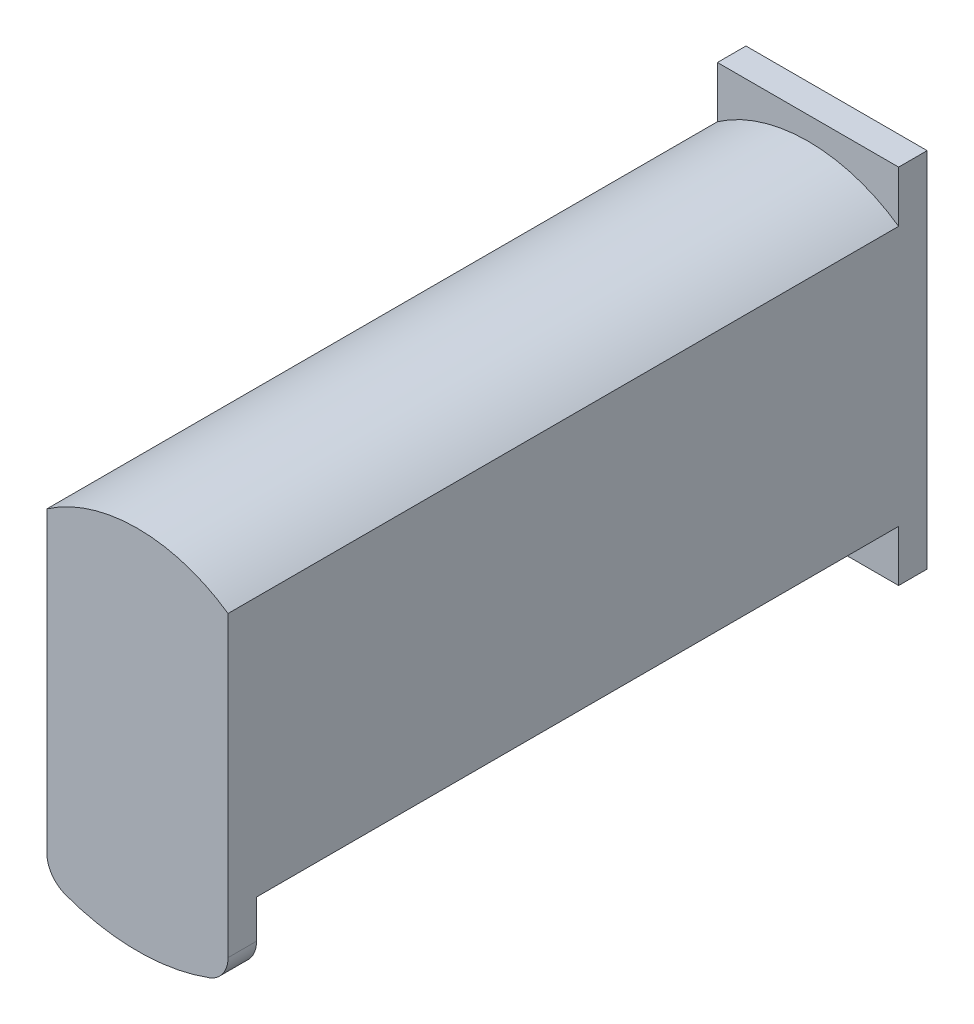
ISO-10303-21;
HEADER;
FILE_DESCRIPTION(('STEP AP214'),'2;1');
FILE_NAME('part.step','',(''),(''),'','','');
FILE_SCHEMA(('AUTOMOTIVE_DESIGN { 1 0 10303 214 1 1 1 1 }'));
ENDSEC;
DATA;
#1=APPLICATION_CONTEXT('core data for automotive mechanical design processes');
#2=APPLICATION_PROTOCOL_DEFINITION('international standard','automotive_design',2000,#1);
#3=PRODUCT_CONTEXT('',#1,'mechanical');
#4=PRODUCT('Part','Part','',(#3));
#5=PRODUCT_RELATED_PRODUCT_CATEGORY('part','',(#4));
#6=PRODUCT_DEFINITION_FORMATION('','',#4);
#7=PRODUCT_DEFINITION_CONTEXT('part definition',#1,'design');
#8=PRODUCT_DEFINITION('design','',#6,#7);
#9=PRODUCT_DEFINITION_SHAPE('','',#8);
#10=(LENGTH_UNIT() NAMED_UNIT(*) SI_UNIT(.MILLI.,.METRE.));
#11=(NAMED_UNIT(*) PLANE_ANGLE_UNIT() SI_UNIT($,.RADIAN.));
#12=(NAMED_UNIT(*) SI_UNIT($,.STERADIAN.) SOLID_ANGLE_UNIT());
#13=UNCERTAINTY_MEASURE_WITH_UNIT(LENGTH_MEASURE(1.E-05),#10,'distance_accuracy_value','');
#14=(GEOMETRIC_REPRESENTATION_CONTEXT(3) GLOBAL_UNCERTAINTY_ASSIGNED_CONTEXT((#13)) GLOBAL_UNIT_ASSIGNED_CONTEXT((#10,
#11,#12)) REPRESENTATION_CONTEXT('',''));
#15=CARTESIAN_POINT('',(0.,0.,0.));
#16=DIRECTION('',(0.,0.,1.));
#17=DIRECTION('',(1.,0.,0.));
#18=AXIS2_PLACEMENT_3D('',#15,#16,#17);
#19=CARTESIAN_POINT('',(5.74999999999999,19.2,14.));
#20=DIRECTION('',(1.,0.,0.));
#21=DIRECTION('',(0.,1.,0.));
#22=AXIS2_PLACEMENT_3D('',#19,#20,#21);
#23=PLANE('',#22);
#24=DIRECTION('',(0.,-1.,0.));
#25=VECTOR('',#24,1.);
#26=CARTESIAN_POINT('',(5.74999999999999,19.2,8.));
#27=LINE('',#26,#25);
#28=CARTESIAN_POINT('',(5.74999999999999,19.2,8.));
#29=VERTEX_POINT('',#28);
#30=CARTESIAN_POINT('',(5.74999999999999,6.2,8.));
#31=VERTEX_POINT('',#30);
#32=EDGE_CURVE('E271',#29,#31,#27,.T.);
#33=ORIENTED_EDGE('',*,*,#32,.T.);
#34=DIRECTION('',(0.,0.,-1.));
#35=VECTOR('',#34,1.);
#36=CARTESIAN_POINT('',(5.74999999999999,6.2,14.));
#37=LINE('',#36,#35);
#38=CARTESIAN_POINT('',(5.74999999999999,6.2,14.));
#39=VERTEX_POINT('',#38);
#40=EDGE_CURVE('E287',#39,#31,#37,.T.);
#41=ORIENTED_EDGE('',*,*,#40,.F.);
#42=DIRECTION('',(0.,-1.,0.));
#43=VECTOR('',#42,1.);
#44=CARTESIAN_POINT('',(5.74999999999999,19.2,14.));
#45=LINE('',#44,#43);
#46=CARTESIAN_POINT('',(5.74999999999999,19.2,14.));
#47=VERTEX_POINT('',#46);
#48=EDGE_CURVE('E299',#47,#39,#45,.T.);
#49=ORIENTED_EDGE('',*,*,#48,.F.);
#50=DIRECTION('',(0.,0.,-1.));
#51=VECTOR('',#50,1.);
#52=CARTESIAN_POINT('',(5.74999999999999,19.2,14.));
#53=LINE('',#52,#51);
#54=EDGE_CURVE('E254',#47,#29,#53,.T.);
#55=ORIENTED_EDGE('',*,*,#54,.T.);
#56=EDGE_LOOP('',(#33,#41,#49,#55));
#57=FACE_BOUND('',#56,.T.);
#58=ADVANCED_FACE('F69',(#57),#23,.F.);
#59=CARTESIAN_POINT('',(5.74999999999999,19.2,14.));
#60=DIRECTION('',(0.,-1.,0.));
#61=DIRECTION('',(1.,0.,0.));
#62=AXIS2_PLACEMENT_3D('',#59,#60,#61);
#63=PLANE('',#62);
#64=DIRECTION('',(-1.,0.,0.));
#65=VECTOR('',#64,1.);
#66=CARTESIAN_POINT('',(5.74999999999999,19.2,8.));
#67=LINE('',#66,#65);
#68=CARTESIAN_POINT('',(-5.75000000000001,19.2,8.));
#69=VERTEX_POINT('',#68);
#70=EDGE_CURVE('E296',#29,#69,#67,.T.);
#71=ORIENTED_EDGE('',*,*,#70,.F.);
#72=ORIENTED_EDGE('',*,*,#54,.F.);
#73=DIRECTION('',(-1.,0.,0.));
#74=VECTOR('',#73,1.);
#75=CARTESIAN_POINT('',(5.74999999999999,19.2,14.));
#76=LINE('',#75,#74);
#77=CARTESIAN_POINT('',(-5.75000000000001,19.2,14.));
#78=VERTEX_POINT('',#77);
#79=EDGE_CURVE('E289',#47,#78,#76,.T.);
#80=ORIENTED_EDGE('',*,*,#79,.T.);
#81=DIRECTION('',(0.,0.,-1.));
#82=VECTOR('',#81,1.);
#83=CARTESIAN_POINT('',(-5.75000000000001,19.2,14.));
#84=LINE('',#83,#82);
#85=EDGE_CURVE('E292',#78,#69,#84,.T.);
#86=ORIENTED_EDGE('',*,*,#85,.T.);
#87=EDGE_LOOP('',(#71,#72,#80,#86));
#88=FACE_BOUND('',#87,.T.);
#89=ADVANCED_FACE('F407',(#88),#63,.T.);
#90=CARTESIAN_POINT('',(-5.75000000000001,19.2,14.));
#91=DIRECTION('',(1.,0.,0.));
#92=DIRECTION('',(0.,1.,0.));
#93=AXIS2_PLACEMENT_3D('',#90,#91,#92);
#94=PLANE('',#93);
#95=DIRECTION('',(0.,-1.,0.));
#96=VECTOR('',#95,1.);
#97=CARTESIAN_POINT('',(-5.75000000000001,19.2,8.));
#98=LINE('',#97,#96);
#99=CARTESIAN_POINT('',(-5.75000000000001,6.2,8.));
#100=VERTEX_POINT('',#99);
#101=EDGE_CURVE('E298',#69,#100,#98,.T.);
#102=ORIENTED_EDGE('',*,*,#101,.F.);
#103=ORIENTED_EDGE('',*,*,#85,.F.);
#104=DIRECTION('',(0.,-1.,0.));
#105=VECTOR('',#104,1.);
#106=CARTESIAN_POINT('',(-5.75000000000001,19.2,14.));
#107=LINE('',#106,#105);
#108=CARTESIAN_POINT('',(-5.75000000000001,6.2,14.));
#109=VERTEX_POINT('',#108);
#110=EDGE_CURVE('E308',#78,#109,#107,.T.);
#111=ORIENTED_EDGE('',*,*,#110,.T.);
#112=DIRECTION('',(0.,0.,-1.));
#113=VECTOR('',#112,1.);
#114=CARTESIAN_POINT('',(-5.75000000000001,6.2,14.));
#115=LINE('',#114,#113);
#116=EDGE_CURVE('E290',#109,#100,#115,.T.);
#117=ORIENTED_EDGE('',*,*,#116,.T.);
#118=EDGE_LOOP('',(#102,#103,#111,#117));
#119=FACE_BOUND('',#118,.T.);
#120=ADVANCED_FACE('F413',(#119),#94,.T.);
#121=CARTESIAN_POINT('',(5.74999999999999,6.2,14.));
#122=DIRECTION('',(0.,-1.,0.));
#123=DIRECTION('',(1.,0.,0.));
#124=AXIS2_PLACEMENT_3D('',#121,#122,#123);
#125=PLANE('',#124);
#126=DIRECTION('',(-1.,0.,0.));
#127=VECTOR('',#126,1.);
#128=CARTESIAN_POINT('',(5.74999999999999,6.2,8.));
#129=LINE('',#128,#127);
#130=EDGE_CURVE('E302',#31,#100,#129,.T.);
#131=ORIENTED_EDGE('',*,*,#130,.T.);
#132=ORIENTED_EDGE('',*,*,#116,.F.);
#133=DIRECTION('',(-1.,0.,0.));
#134=VECTOR('',#133,1.);
#135=CARTESIAN_POINT('',(5.74999999999999,6.2,14.));
#136=LINE('',#135,#134);
#137=EDGE_CURVE('E310',#39,#109,#136,.T.);
#138=ORIENTED_EDGE('',*,*,#137,.F.);
#139=ORIENTED_EDGE('',*,*,#40,.T.);
#140=EDGE_LOOP('',(#131,#132,#138,#139));
#141=FACE_BOUND('',#140,.T.);
#142=ADVANCED_FACE('F420',(#141),#125,.F.);
#143=CARTESIAN_POINT('',(0.,0.,14.));
#144=DIRECTION('',(0.,0.,-1.));
#145=DIRECTION('',(-1.,0.,0.));
#146=AXIS2_PLACEMENT_3D('',#143,#144,#145);
#147=PLANE('',#146);
#148=CARTESIAN_POINT('',(0.,12.7,14.));
#149=DIRECTION('',(0.,0.,-1.));
#150=DIRECTION('',(-1.,0.,0.));
#151=AXIS2_PLACEMENT_3D('',#148,#149,#150);
#152=CIRCLE('',#151,3.5);
#153=CARTESIAN_POINT('',(-3.5,12.7,14.));
#154=VERTEX_POINT('',#153);
#155=EDGE_CURVE('E247',#154,#154,#152,.F.);
#156=ORIENTED_EDGE('',*,*,#155,.T.);
#157=EDGE_LOOP('',(#156));
#158=FACE_BOUND('',#157,.T.);
#159=ORIENTED_EDGE('',*,*,#48,.T.);
#160=ORIENTED_EDGE('',*,*,#137,.T.);
#161=ORIENTED_EDGE('',*,*,#110,.F.);
#162=ORIENTED_EDGE('',*,*,#79,.F.);
#163=EDGE_LOOP('',(#159,#160,#161,#162));
#164=FACE_BOUND('',#163,.T.);
#165=ADVANCED_FACE('F423',(#158,#164),#147,.T.);
#166=CARTESIAN_POINT('',(0.,0.,8.));
#167=DIRECTION('',(0.,0.,-1.));
#168=DIRECTION('',(-1.,0.,0.));
#169=AXIS2_PLACEMENT_3D('',#166,#167,#168);
#170=PLANE('',#169);
#171=CARTESIAN_POINT('',(0.,12.7,8.));
#172=DIRECTION('',(0.,0.,-1.));
#173=DIRECTION('',(-1.,0.,0.));
#174=AXIS2_PLACEMENT_3D('',#171,#172,#173);
#175=CIRCLE('',#174,3.5);
#176=CARTESIAN_POINT('',(-3.5,12.7,8.));
#177=VERTEX_POINT('',#176);
#178=EDGE_CURVE('E245',#177,#177,#175,.F.);
#179=ORIENTED_EDGE('',*,*,#178,.F.);
#180=EDGE_LOOP('',(#179));
#181=FACE_BOUND('',#180,.T.);
#182=ORIENTED_EDGE('',*,*,#32,.F.);
#183=ORIENTED_EDGE('',*,*,#70,.T.);
#184=ORIENTED_EDGE('',*,*,#101,.T.);
#185=ORIENTED_EDGE('',*,*,#130,.F.);
#186=EDGE_LOOP('',(#182,#183,#184,#185));
#187=FACE_BOUND('',#186,.T.);
#188=ADVANCED_FACE('F428',(#181,#187),#170,.F.);
#189=CARTESIAN_POINT('',(0.,12.7,25.));
#190=DIRECTION('',(0.,0.,-1.));
#191=DIRECTION('',(-1.,0.,0.));
#192=AXIS2_PLACEMENT_3D('',#189,#190,#191);
#193=CYLINDRICAL_SURFACE('',#192,3.5);
#194=ORIENTED_EDGE('',*,*,#155,.F.);
#195=EDGE_LOOP('',(#194));
#196=FACE_BOUND('',#195,.T.);
#197=CARTESIAN_POINT('',(0.,12.7,25.));
#198=DIRECTION('',(0.,0.,1.));
#199=DIRECTION('',(1.,0.,0.));
#200=AXIS2_PLACEMENT_3D('',#197,#198,#199);
#201=CIRCLE('',#200,3.5);
#202=CARTESIAN_POINT('',(3.5,12.7,25.));
#203=VERTEX_POINT('',#202);
#204=EDGE_CURVE('E232',#203,#203,#201,.T.);
#205=ORIENTED_EDGE('',*,*,#204,.T.);
#206=EDGE_LOOP('',(#205));
#207=FACE_BOUND('',#206,.T.);
#208=ADVANCED_FACE('F431',(#196,#207),#193,.F.);
#209=CARTESIAN_POINT('',(0.,12.7,25.));
#210=DIRECTION('',(0.,0.,1.));
#211=DIRECTION('',(1.,0.,0.));
#212=AXIS2_PLACEMENT_3D('',#209,#210,#211);
#213=PLANE('',#212);
#214=ORIENTED_EDGE('',*,*,#204,.F.);
#215=EDGE_LOOP('',(#214));
#216=FACE_BOUND('',#215,.T.);
#217=ADVANCED_FACE('F580',(#216),#213,.F.);
#218=CARTESIAN_POINT('',(0.,0.,4.));
#219=DIRECTION('',(0.,0.,1.));
#220=DIRECTION('',(1.,0.,0.));
#221=AXIS2_PLACEMENT_3D('',#218,#219,#220);
#222=PLANE('',#221);
#223=CARTESIAN_POINT('',(0.,0.,4.));
#224=DIRECTION('',(0.,0.,1.));
#225=DIRECTION('',(1.,0.,0.));
#226=AXIS2_PLACEMENT_3D('',#223,#224,#225);
#227=CIRCLE('',#226,22.2);
#228=CARTESIAN_POINT('',(-12.7,-18.2085144918524,4.));
#229=VERTEX_POINT('',#228);
#230=CARTESIAN_POINT('',(12.7,-18.2085144918524,4.));
#231=VERTEX_POINT('',#230);
#232=EDGE_CURVE('E280',#229,#231,#227,.T.);
#233=ORIENTED_EDGE('',*,*,#232,.F.);
#234=DIRECTION('',(0.,1.,0.));
#235=VECTOR('',#234,1.);
#236=CARTESIAN_POINT('',(-12.7,-25.4,4.));
#237=LINE('',#236,#235);
#238=CARTESIAN_POINT('',(-12.7,-25.4,4.));
#239=VERTEX_POINT('',#238);
#240=EDGE_CURVE('E341',#239,#229,#237,.T.);
#241=ORIENTED_EDGE('',*,*,#240,.F.);
#242=DIRECTION('',(-1.,0.,0.));
#243=VECTOR('',#242,1.);
#244=CARTESIAN_POINT('',(12.7,-25.4,4.));
#245=LINE('',#244,#243);
#246=CARTESIAN_POINT('',(12.7,-25.4,4.));
#247=VERTEX_POINT('',#246);
#248=EDGE_CURVE('E344',#247,#239,#245,.T.);
#249=ORIENTED_EDGE('',*,*,#248,.F.);
#250=DIRECTION('',(0.,1.,0.));
#251=VECTOR('',#250,1.);
#252=CARTESIAN_POINT('',(12.7,-25.4,4.));
#253=LINE('',#252,#251);
#254=EDGE_CURVE('E335',#247,#231,#253,.T.);
#255=ORIENTED_EDGE('',*,*,#254,.T.);
#256=EDGE_LOOP('',(#233,#241,#249,#255));
#257=FACE_BOUND('',#256,.T.);
#258=ADVANCED_FACE('F453',(#257),#222,.T.);
#259=CARTESIAN_POINT('',(0.,0.,4.));
#260=DIRECTION('',(0.,0.,1.));
#261=DIRECTION('',(1.,0.,0.));
#262=AXIS2_PLACEMENT_3D('',#259,#260,#261);
#263=CIRCLE('',#262,22.2);
#264=CARTESIAN_POINT('',(12.7,18.2085144918524,4.));
#265=VERTEX_POINT('',#264);
#266=CARTESIAN_POINT('',(-12.7,18.2085144918524,4.));
#267=VERTEX_POINT('',#266);
#268=EDGE_CURVE('E319',#265,#267,#263,.T.);
#269=ORIENTED_EDGE('',*,*,#268,.F.);
#270=CARTESIAN_POINT('',(12.7,25.4,4.));
#271=VERTEX_POINT('',#270);
#272=EDGE_CURVE('E221',#265,#271,#253,.T.);
#273=ORIENTED_EDGE('',*,*,#272,.T.);
#274=DIRECTION('',(-1.,0.,0.));
#275=VECTOR('',#274,1.);
#276=CARTESIAN_POINT('',(12.7,25.4,4.));
#277=LINE('',#276,#275);
#278=CARTESIAN_POINT('',(-12.7,25.4,4.));
#279=VERTEX_POINT('',#278);
#280=EDGE_CURVE('E337',#271,#279,#277,.T.);
#281=ORIENTED_EDGE('',*,*,#280,.T.);
#282=EDGE_CURVE('E340',#267,#279,#237,.T.);
#283=ORIENTED_EDGE('',*,*,#282,.F.);
#284=EDGE_LOOP('',(#269,#273,#281,#283));
#285=FACE_BOUND('',#284,.T.);
#286=ADVANCED_FACE('F449',(#285),#222,.T.);
#287=CARTESIAN_POINT('',(0.,0.,0.));
#288=DIRECTION('',(0.,0.,1.));
#289=DIRECTION('',(1.,0.,0.));
#290=AXIS2_PLACEMENT_3D('',#287,#288,#289);
#291=PLANE('',#290);
#292=DIRECTION('',(0.,1.,0.));
#293=VECTOR('',#292,1.);
#294=CARTESIAN_POINT('',(12.7,-25.4,0.));
#295=LINE('',#294,#293);
#296=CARTESIAN_POINT('',(12.7,-25.4,0.));
#297=VERTEX_POINT('',#296);
#298=CARTESIAN_POINT('',(12.7,25.4,0.));
#299=VERTEX_POINT('',#298);
#300=EDGE_CURVE('E334',#297,#299,#295,.T.);
#301=ORIENTED_EDGE('',*,*,#300,.F.);
#302=DIRECTION('',(-1.,0.,0.));
#303=VECTOR('',#302,1.);
#304=CARTESIAN_POINT('',(12.7,-25.4,0.));
#305=LINE('',#304,#303);
#306=CARTESIAN_POINT('',(-12.7,-25.4,0.));
#307=VERTEX_POINT('',#306);
#308=EDGE_CURVE('E356',#297,#307,#305,.T.);
#309=ORIENTED_EDGE('',*,*,#308,.T.);
#310=DIRECTION('',(0.,1.,0.));
#311=VECTOR('',#310,1.);
#312=CARTESIAN_POINT('',(-12.7,-25.4,0.));
#313=LINE('',#312,#311);
#314=CARTESIAN_POINT('',(-12.7,25.4,0.));
#315=VERTEX_POINT('',#314);
#316=EDGE_CURVE('E353',#307,#315,#313,.T.);
#317=ORIENTED_EDGE('',*,*,#316,.T.);
#318=DIRECTION('',(-1.,0.,0.));
#319=VECTOR('',#318,1.);
#320=CARTESIAN_POINT('',(12.7,25.4,0.));
#321=LINE('',#320,#319);
#322=EDGE_CURVE('E350',#299,#315,#321,.T.);
#323=ORIENTED_EDGE('',*,*,#322,.F.);
#324=EDGE_LOOP('',(#301,#309,#317,#323));
#325=FACE_BOUND('',#324,.T.);
#326=CARTESIAN_POINT('',(0.,12.7,0.));
#327=DIRECTION('',(0.,0.,1.));
#328=DIRECTION('',(1.,0.,0.));
#329=AXIS2_PLACEMENT_3D('',#326,#327,#328);
#330=CIRCLE('',#329,3.5);
#331=CARTESIAN_POINT('',(3.5,12.7,0.));
#332=VERTEX_POINT('',#331);
#333=EDGE_CURVE('E331',#332,#332,#330,.T.);
#334=ORIENTED_EDGE('',*,*,#333,.T.);
#335=EDGE_LOOP('',(#334));
#336=FACE_BOUND('',#335,.T.);
#337=CARTESIAN_POINT('',(0.,-12.7,0.));
#338=DIRECTION('',(0.,0.,1.));
#339=DIRECTION('',(1.,0.,0.));
#340=AXIS2_PLACEMENT_3D('',#337,#338,#339);
#341=CIRCLE('',#340,3.5);
#342=CARTESIAN_POINT('',(3.5,-12.7,0.));
#343=VERTEX_POINT('',#342);
#344=EDGE_CURVE('E328',#343,#343,#341,.T.);
#345=ORIENTED_EDGE('',*,*,#344,.T.);
#346=EDGE_LOOP('',(#345));
#347=FACE_BOUND('',#346,.T.);
#348=ADVANCED_FACE('F452',(#325,#336,#347),#291,.F.);
#349=CARTESIAN_POINT('',(12.7,-25.4,4.));
#350=DIRECTION('',(-1.,0.,0.));
#351=DIRECTION('',(0.,0.,1.));
#352=AXIS2_PLACEMENT_3D('',#349,#350,#351);
#353=PLANE('',#352);
#354=DIRECTION('',(0.,1.,0.));
#355=VECTOR('',#354,1.);
#356=CARTESIAN_POINT('',(12.7,-18.2085144918524,98.));
#357=LINE('',#356,#355);
#358=CARTESIAN_POINT('',(12.7,-23.5690158759594,98.));
#359=VERTEX_POINT('',#358);
#360=CARTESIAN_POINT('',(12.7,18.2085144918524,98.));
#361=VERTEX_POINT('',#360);
#362=EDGE_CURVE('E207',#359,#361,#357,.T.);
#363=ORIENTED_EDGE('',*,*,#362,.F.);
#364=DIRECTION('',(0.,0.,-1.));
#365=VECTOR('',#364,1.);
#366=CARTESIAN_POINT('',(12.7,-23.5690158759594,4.));
#367=LINE('',#366,#365);
#368=CARTESIAN_POINT('',(12.7,-23.5690158759594,94.));
#369=VERTEX_POINT('',#368);
#370=EDGE_CURVE('E12',#359,#369,#367,.T.);
#371=ORIENTED_EDGE('',*,*,#370,.T.);
#372=DIRECTION('',(0.,1.,0.));
#373=VECTOR('',#372,1.);
#374=CARTESIAN_POINT('',(12.7,-18.2085144918524,94.));
#375=LINE('',#374,#373);
#376=CARTESIAN_POINT('',(12.7,-18.2085144918524,94.));
#377=VERTEX_POINT('',#376);
#378=EDGE_CURVE('E239',#369,#377,#375,.T.);
#379=ORIENTED_EDGE('',*,*,#378,.T.);
#380=DIRECTION('',(0.,0.,-1.));
#381=VECTOR('',#380,1.);
#382=CARTESIAN_POINT('',(12.7,-18.2085144918524,94.));
#383=LINE('',#382,#381);
#384=EDGE_CURVE('E224',#377,#231,#383,.T.);
#385=ORIENTED_EDGE('',*,*,#384,.T.);
#386=ORIENTED_EDGE('',*,*,#254,.F.);
#387=DIRECTION('',(0.,0.,-1.));
#388=VECTOR('',#387,1.);
#389=CARTESIAN_POINT('',(12.7,-25.4,4.));
#390=LINE('',#389,#388);
#391=EDGE_CURVE('E347',#247,#297,#390,.T.);
#392=ORIENTED_EDGE('',*,*,#391,.T.);
#393=ORIENTED_EDGE('',*,*,#300,.T.);
#394=DIRECTION('',(0.,0.,-1.));
#395=VECTOR('',#394,1.);
#396=CARTESIAN_POINT('',(12.7,25.4,4.));
#397=LINE('',#396,#395);
#398=EDGE_CURVE('E364',#271,#299,#397,.T.);
#399=ORIENTED_EDGE('',*,*,#398,.F.);
#400=ORIENTED_EDGE('',*,*,#272,.F.);
#401=DIRECTION('',(0.,0.,-1.));
#402=VECTOR('',#401,1.);
#403=CARTESIAN_POINT('',(12.7,18.2085144918524,94.));
#404=LINE('',#403,#402);
#405=EDGE_CURVE('E218',#361,#265,#404,.T.);
#406=ORIENTED_EDGE('',*,*,#405,.F.);
#407=EDGE_LOOP('',(#363,#371,#379,#385,#386,#392,#393,#399,#400,#406));
#408=FACE_BOUND('',#407,.T.);
#409=ADVANCED_FACE('F219',(#408),#353,.F.);
#410=CARTESIAN_POINT('',(12.7,25.4,4.));
#411=DIRECTION('',(0.,-1.,0.));
#412=DIRECTION('',(0.,0.,-1.));
#413=AXIS2_PLACEMENT_3D('',#410,#411,#412);
#414=PLANE('',#413);
#415=ORIENTED_EDGE('',*,*,#322,.T.);
#416=DIRECTION('',(0.,0.,-1.));
#417=VECTOR('',#416,1.);
#418=CARTESIAN_POINT('',(-12.7,25.4,4.));
#419=LINE('',#418,#417);
#420=EDGE_CURVE('E362',#279,#315,#419,.T.);
#421=ORIENTED_EDGE('',*,*,#420,.F.);
#422=ORIENTED_EDGE('',*,*,#280,.F.);
#423=ORIENTED_EDGE('',*,*,#398,.T.);
#424=EDGE_LOOP('',(#415,#421,#422,#423));
#425=FACE_BOUND('',#424,.T.);
#426=ADVANCED_FACE('F463',(#425),#414,.F.);
#427=CARTESIAN_POINT('',(-12.7,-25.4,4.));
#428=DIRECTION('',(-1.,0.,0.));
#429=DIRECTION('',(0.,0.,1.));
#430=AXIS2_PLACEMENT_3D('',#427,#428,#429);
#431=PLANE('',#430);
#432=DIRECTION('',(0.,-1.,0.));
#433=VECTOR('',#432,1.);
#434=CARTESIAN_POINT('',(-12.7,18.2085144918524,94.));
#435=LINE('',#434,#433);
#436=CARTESIAN_POINT('',(-12.7,-18.2085144918524,94.));
#437=VERTEX_POINT('',#436);
#438=CARTESIAN_POINT('',(-12.7,-23.5690158759594,94.));
#439=VERTEX_POINT('',#438);
#440=EDGE_CURVE('E241',#437,#439,#435,.T.);
#441=ORIENTED_EDGE('',*,*,#440,.T.);
#442=DIRECTION('',(0.,0.,1.));
#443=VECTOR('',#442,1.);
#444=CARTESIAN_POINT('',(-12.7,-23.5690158759594,98.));
#445=LINE('',#444,#443);
#446=CARTESIAN_POINT('',(-12.7,-23.5690158759594,98.));
#447=VERTEX_POINT('',#446);
#448=EDGE_CURVE('E92',#439,#447,#445,.T.);
#449=ORIENTED_EDGE('',*,*,#448,.T.);
#450=DIRECTION('',(0.,-1.,0.));
#451=VECTOR('',#450,1.);
#452=CARTESIAN_POINT('',(-12.7,-26.2085144918524,98.));
#453=LINE('',#452,#451);
#454=CARTESIAN_POINT('',(-12.7,18.2085144918524,98.));
#455=VERTEX_POINT('',#454);
#456=EDGE_CURVE('E243',#455,#447,#453,.T.);
#457=ORIENTED_EDGE('',*,*,#456,.F.);
#458=DIRECTION('',(0.,0.,-1.));
#459=VECTOR('',#458,1.);
#460=CARTESIAN_POINT('',(-12.7,18.2085144918524,94.));
#461=LINE('',#460,#459);
#462=EDGE_CURVE('E225',#455,#267,#461,.T.);
#463=ORIENTED_EDGE('',*,*,#462,.T.);
#464=ORIENTED_EDGE('',*,*,#282,.T.);
#465=ORIENTED_EDGE('',*,*,#420,.T.);
#466=ORIENTED_EDGE('',*,*,#316,.F.);
#467=DIRECTION('',(0.,0.,-1.));
#468=VECTOR('',#467,1.);
#469=CARTESIAN_POINT('',(-12.7,-25.4,4.));
#470=LINE('',#469,#468);
#471=EDGE_CURVE('E360',#239,#307,#470,.T.);
#472=ORIENTED_EDGE('',*,*,#471,.F.);
#473=ORIENTED_EDGE('',*,*,#240,.T.);
#474=DIRECTION('',(0.,0.,-1.));
#475=VECTOR('',#474,1.);
#476=CARTESIAN_POINT('',(-12.7,-18.2085144918524,94.));
#477=LINE('',#476,#475);
#478=EDGE_CURVE('E318',#437,#229,#477,.T.);
#479=ORIENTED_EDGE('',*,*,#478,.F.);
#480=EDGE_LOOP('',(#441,#449,#457,#463,#464,#465,#466,#472,#473,#479));
#481=FACE_BOUND('',#480,.T.);
#482=ADVANCED_FACE('F393',(#481),#431,.T.);
#483=CARTESIAN_POINT('',(12.7,-25.4,4.));
#484=DIRECTION('',(0.,-1.,0.));
#485=DIRECTION('',(0.,0.,-1.));
#486=AXIS2_PLACEMENT_3D('',#483,#484,#485);
#487=PLANE('',#486);
#488=ORIENTED_EDGE('',*,*,#308,.F.);
#489=ORIENTED_EDGE('',*,*,#391,.F.);
#490=ORIENTED_EDGE('',*,*,#248,.T.);
#491=ORIENTED_EDGE('',*,*,#471,.T.);
#492=EDGE_LOOP('',(#488,#489,#490,#491));
#493=FACE_BOUND('',#492,.T.);
#494=ADVANCED_FACE('F447',(#493),#487,.T.);
#495=CARTESIAN_POINT('',(0.,12.7,4.));
#496=DIRECTION('',(0.,0.,-1.));
#497=DIRECTION('',(-1.,0.,0.));
#498=AXIS2_PLACEMENT_3D('',#495,#496,#497);
#499=CYLINDRICAL_SURFACE('',#498,3.5);
#500=ORIENTED_EDGE('',*,*,#333,.F.);
#501=EDGE_LOOP('',(#500));
#502=FACE_BOUND('',#501,.T.);
#503=ORIENTED_EDGE('',*,*,#178,.T.);
#504=EDGE_LOOP('',(#503));
#505=FACE_BOUND('',#504,.T.);
#506=ADVANCED_FACE('F443',(#502,#505),#499,.F.);
#507=CARTESIAN_POINT('',(0.,-12.7,4.));
#508=DIRECTION('',(0.,0.,-1.));
#509=DIRECTION('',(-1.,0.,0.));
#510=AXIS2_PLACEMENT_3D('',#507,#508,#509);
#511=CYLINDRICAL_SURFACE('',#510,3.5);
#512=ORIENTED_EDGE('',*,*,#344,.F.);
#513=EDGE_LOOP('',(#512));
#514=FACE_BOUND('',#513,.T.);
#515=CARTESIAN_POINT('',(0.,-12.7,8.));
#516=DIRECTION('',(0.,0.,-1.));
#517=DIRECTION('',(-1.,0.,0.));
#518=AXIS2_PLACEMENT_3D('',#515,#516,#517);
#519=CIRCLE('',#518,3.5);
#520=CARTESIAN_POINT('',(-3.5,-12.7,8.));
#521=VERTEX_POINT('',#520);
#522=EDGE_CURVE('E250',#521,#521,#519,.F.);
#523=ORIENTED_EDGE('',*,*,#522,.T.);
#524=EDGE_LOOP('',(#523));
#525=FACE_BOUND('',#524,.T.);
#526=ADVANCED_FACE('F438',(#514,#525),#511,.F.);
#527=CARTESIAN_POINT('',(0.,0.,94.));
#528=DIRECTION('',(0.,0.,-1.));
#529=DIRECTION('',(-1.,0.,0.));
#530=AXIS2_PLACEMENT_3D('',#527,#528,#529);
#531=CYLINDRICAL_SURFACE('',#530,22.2);
#532=ORIENTED_EDGE('',*,*,#268,.T.);
#533=ORIENTED_EDGE('',*,*,#462,.F.);
#534=CARTESIAN_POINT('',(0.,0.,98.));
#535=DIRECTION('',(0.,0.,1.));
#536=DIRECTION('',(1.,0.,0.));
#537=AXIS2_PLACEMENT_3D('',#534,#535,#536);
#538=CIRCLE('',#537,22.2);
#539=EDGE_CURVE('E211',#361,#455,#538,.T.);
#540=ORIENTED_EDGE('',*,*,#539,.F.);
#541=ORIENTED_EDGE('',*,*,#405,.T.);
#542=EDGE_LOOP('',(#532,#533,#540,#541));
#543=FACE_BOUND('',#542,.T.);
#544=ADVANCED_FACE('F227',(#543),#531,.T.);
#545=CARTESIAN_POINT('',(0.,0.,94.));
#546=DIRECTION('',(0.,0.,-1.));
#547=DIRECTION('',(-1.,0.,0.));
#548=AXIS2_PLACEMENT_3D('',#545,#546,#547);
#549=CYLINDRICAL_SURFACE('',#548,22.2);
#550=ORIENTED_EDGE('',*,*,#232,.T.);
#551=ORIENTED_EDGE('',*,*,#384,.F.);
#552=CARTESIAN_POINT('',(0.,0.,94.));
#553=DIRECTION('',(0.,0.,1.));
#554=DIRECTION('',(1.,0.,0.));
#555=AXIS2_PLACEMENT_3D('',#552,#553,#554);
#556=CIRCLE('',#555,22.2);
#557=EDGE_CURVE('E315',#437,#377,#556,.T.);
#558=ORIENTED_EDGE('',*,*,#557,.F.);
#559=ORIENTED_EDGE('',*,*,#478,.T.);
#560=EDGE_LOOP('',(#550,#551,#558,#559));
#561=FACE_BOUND('',#560,.T.);
#562=ADVANCED_FACE('F398',(#561),#549,.T.);
#563=CARTESIAN_POINT('',(5.75,-6.2,14.));
#564=DIRECTION('',(1.,0.,0.));
#565=DIRECTION('',(0.,1.,0.));
#566=AXIS2_PLACEMENT_3D('',#563,#564,#565);
#567=PLANE('',#566);
#568=DIRECTION('',(0.,-1.,0.));
#569=VECTOR('',#568,1.);
#570=CARTESIAN_POINT('',(5.75,-6.2,8.));
#571=LINE('',#570,#569);
#572=CARTESIAN_POINT('',(5.75,-6.2,8.));
#573=VERTEX_POINT('',#572);
#574=CARTESIAN_POINT('',(5.75000000000001,-19.2,8.));
#575=VERTEX_POINT('',#574);
#576=EDGE_CURVE('E267',#573,#575,#571,.T.);
#577=ORIENTED_EDGE('',*,*,#576,.T.);
#578=DIRECTION('',(0.,0.,-1.));
#579=VECTOR('',#578,1.);
#580=CARTESIAN_POINT('',(5.75000000000001,-19.2,14.));
#581=LINE('',#580,#579);
#582=CARTESIAN_POINT('',(5.75000000000001,-19.2,14.));
#583=VERTEX_POINT('',#582);
#584=EDGE_CURVE('E266',#583,#575,#581,.T.);
#585=ORIENTED_EDGE('',*,*,#584,.F.);
#586=DIRECTION('',(0.,-1.,0.));
#587=VECTOR('',#586,1.);
#588=CARTESIAN_POINT('',(5.75,-6.2,14.));
#589=LINE('',#588,#587);
#590=CARTESIAN_POINT('',(5.75,-6.2,14.));
#591=VERTEX_POINT('',#590);
#592=EDGE_CURVE('E255',#591,#583,#589,.T.);
#593=ORIENTED_EDGE('',*,*,#592,.F.);
#594=DIRECTION('',(0.,0.,-1.));
#595=VECTOR('',#594,1.);
#596=CARTESIAN_POINT('',(5.75,-6.2,14.));
#597=LINE('',#596,#595);
#598=EDGE_CURVE('E278',#591,#573,#597,.T.);
#599=ORIENTED_EDGE('',*,*,#598,.T.);
#600=EDGE_LOOP('',(#577,#585,#593,#599));
#601=FACE_BOUND('',#600,.T.);
#602=ADVANCED_FACE('F418',(#601),#567,.F.);
#603=CARTESIAN_POINT('',(5.75,-6.2,14.));
#604=DIRECTION('',(0.,-1.,0.));
#605=DIRECTION('',(1.,0.,0.));
#606=AXIS2_PLACEMENT_3D('',#603,#604,#605);
#607=PLANE('',#606);
#608=DIRECTION('',(-1.,0.,0.));
#609=VECTOR('',#608,1.);
#610=CARTESIAN_POINT('',(5.75,-6.2,8.));
#611=LINE('',#610,#609);
#612=CARTESIAN_POINT('',(-5.75,-6.2,8.));
#613=VERTEX_POINT('',#612);
#614=EDGE_CURVE('E259',#573,#613,#611,.T.);
#615=ORIENTED_EDGE('',*,*,#614,.F.);
#616=ORIENTED_EDGE('',*,*,#598,.F.);
#617=DIRECTION('',(-1.,0.,0.));
#618=VECTOR('',#617,1.);
#619=CARTESIAN_POINT('',(5.75,-6.2,14.));
#620=LINE('',#619,#618);
#621=CARTESIAN_POINT('',(-5.75,-6.2,14.));
#622=VERTEX_POINT('',#621);
#623=EDGE_CURVE('E264',#591,#622,#620,.T.);
#624=ORIENTED_EDGE('',*,*,#623,.T.);
#625=DIRECTION('',(0.,0.,-1.));
#626=VECTOR('',#625,1.);
#627=CARTESIAN_POINT('',(-5.75,-6.2,14.));
#628=LINE('',#627,#626);
#629=EDGE_CURVE('E281',#622,#613,#628,.T.);
#630=ORIENTED_EDGE('',*,*,#629,.T.);
#631=EDGE_LOOP('',(#615,#616,#624,#630));
#632=FACE_BOUND('',#631,.T.);
#633=ADVANCED_FACE('F654',(#632),#607,.T.);
#634=CARTESIAN_POINT('',(-5.75,-6.2,14.));
#635=DIRECTION('',(1.,0.,0.));
#636=DIRECTION('',(0.,0.,-1.));
#637=AXIS2_PLACEMENT_3D('',#634,#635,#636);
#638=PLANE('',#637);
#639=DIRECTION('',(0.,-1.,0.));
#640=VECTOR('',#639,1.);
#641=CARTESIAN_POINT('',(-5.75,-6.2,8.));
#642=LINE('',#641,#640);
#643=CARTESIAN_POINT('',(-5.75,-19.2,8.));
#644=VERTEX_POINT('',#643);
#645=EDGE_CURVE('E274',#613,#644,#642,.T.);
#646=ORIENTED_EDGE('',*,*,#645,.F.);
#647=ORIENTED_EDGE('',*,*,#629,.F.);
#648=DIRECTION('',(0.,-1.,0.));
#649=VECTOR('',#648,1.);
#650=CARTESIAN_POINT('',(-5.75,-6.2,14.));
#651=LINE('',#650,#649);
#652=CARTESIAN_POINT('',(-5.75,-19.2,14.));
#653=VERTEX_POINT('',#652);
#654=EDGE_CURVE('E262',#622,#653,#651,.T.);
#655=ORIENTED_EDGE('',*,*,#654,.T.);
#656=DIRECTION('',(0.,0.,-1.));
#657=VECTOR('',#656,1.);
#658=CARTESIAN_POINT('',(-5.75,-19.2,14.));
#659=LINE('',#658,#657);
#660=EDGE_CURVE('E284',#653,#644,#659,.T.);
#661=ORIENTED_EDGE('',*,*,#660,.T.);
#662=EDGE_LOOP('',(#646,#647,#655,#661));
#663=FACE_BOUND('',#662,.T.);
#664=ADVANCED_FACE('F646',(#663),#638,.T.);
#665=CARTESIAN_POINT('',(5.75000000000001,-19.2,14.));
#666=DIRECTION('',(0.,-1.,0.));
#667=DIRECTION('',(1.,0.,0.));
#668=AXIS2_PLACEMENT_3D('',#665,#666,#667);
#669=PLANE('',#668);
#670=DIRECTION('',(-1.,0.,0.));
#671=VECTOR('',#670,1.);
#672=CARTESIAN_POINT('',(5.75000000000001,-19.2,8.));
#673=LINE('',#672,#671);
#674=EDGE_CURVE('E270',#575,#644,#673,.T.);
#675=ORIENTED_EDGE('',*,*,#674,.T.);
#676=ORIENTED_EDGE('',*,*,#660,.F.);
#677=DIRECTION('',(-1.,0.,0.));
#678=VECTOR('',#677,1.);
#679=CARTESIAN_POINT('',(5.75000000000001,-19.2,14.));
#680=LINE('',#679,#678);
#681=EDGE_CURVE('E258',#583,#653,#680,.T.);
#682=ORIENTED_EDGE('',*,*,#681,.F.);
#683=ORIENTED_EDGE('',*,*,#584,.T.);
#684=EDGE_LOOP('',(#675,#676,#682,#683));
#685=FACE_BOUND('',#684,.T.);
#686=ADVANCED_FACE('F638',(#685),#669,.F.);
#687=CARTESIAN_POINT('',(0.,0.,14.));
#688=DIRECTION('',(0.,0.,-1.));
#689=DIRECTION('',(-1.,0.,0.));
#690=AXIS2_PLACEMENT_3D('',#687,#688,#689);
#691=PLANE('',#690);
#692=CARTESIAN_POINT('',(0.,-12.7,14.));
#693=DIRECTION('',(0.,0.,-1.));
#694=DIRECTION('',(-1.,0.,0.));
#695=AXIS2_PLACEMENT_3D('',#692,#693,#694);
#696=CIRCLE('',#695,3.5);
#697=CARTESIAN_POINT('',(-3.5,-12.7,14.));
#698=VERTEX_POINT('',#697);
#699=EDGE_CURVE('E251',#698,#698,#696,.F.);
#700=ORIENTED_EDGE('',*,*,#699,.T.);
#701=EDGE_LOOP('',(#700));
#702=FACE_BOUND('',#701,.T.);
#703=ORIENTED_EDGE('',*,*,#592,.T.);
#704=ORIENTED_EDGE('',*,*,#681,.T.);
#705=ORIENTED_EDGE('',*,*,#654,.F.);
#706=ORIENTED_EDGE('',*,*,#623,.F.);
#707=EDGE_LOOP('',(#703,#704,#705,#706));
#708=FACE_BOUND('',#707,.T.);
#709=ADVANCED_FACE('F630',(#702,#708),#691,.T.);
#710=CARTESIAN_POINT('',(0.,0.,8.));
#711=DIRECTION('',(0.,0.,-1.));
#712=DIRECTION('',(-1.,0.,0.));
#713=AXIS2_PLACEMENT_3D('',#710,#711,#712);
#714=PLANE('',#713);
#715=ORIENTED_EDGE('',*,*,#522,.F.);
#716=EDGE_LOOP('',(#715));
#717=FACE_BOUND('',#716,.T.);
#718=ORIENTED_EDGE('',*,*,#576,.F.);
#719=ORIENTED_EDGE('',*,*,#614,.T.);
#720=ORIENTED_EDGE('',*,*,#645,.T.);
#721=ORIENTED_EDGE('',*,*,#674,.F.);
#722=EDGE_LOOP('',(#718,#719,#720,#721));
#723=FACE_BOUND('',#722,.T.);
#724=ADVANCED_FACE('F556',(#717,#723),#714,.F.);
#725=CARTESIAN_POINT('',(0.,-12.7,25.));
#726=DIRECTION('',(0.,0.,-1.));
#727=DIRECTION('',(-1.,0.,0.));
#728=AXIS2_PLACEMENT_3D('',#725,#726,#727);
#729=CYLINDRICAL_SURFACE('',#728,3.5);
#730=ORIENTED_EDGE('',*,*,#699,.F.);
#731=EDGE_LOOP('',(#730));
#732=FACE_BOUND('',#731,.T.);
#733=CARTESIAN_POINT('',(0.,-12.7,25.));
#734=DIRECTION('',(0.,0.,1.));
#735=DIRECTION('',(1.,0.,0.));
#736=AXIS2_PLACEMENT_3D('',#733,#734,#735);
#737=CIRCLE('',#736,3.5);
#738=CARTESIAN_POINT('',(3.5,-12.7,25.));
#739=VERTEX_POINT('',#738);
#740=EDGE_CURVE('E229',#739,#739,#737,.T.);
#741=ORIENTED_EDGE('',*,*,#740,.T.);
#742=EDGE_LOOP('',(#741));
#743=FACE_BOUND('',#742,.T.);
#744=ADVANCED_FACE('F548',(#732,#743),#729,.F.);
#745=CARTESIAN_POINT('',(0.,-12.7,25.));
#746=DIRECTION('',(0.,0.,1.));
#747=DIRECTION('',(1.,0.,0.));
#748=AXIS2_PLACEMENT_3D('',#745,#746,#747);
#749=PLANE('',#748);
#750=ORIENTED_EDGE('',*,*,#740,.F.);
#751=EDGE_LOOP('',(#750));
#752=FACE_BOUND('',#751,.T.);
#753=ADVANCED_FACE('F474',(#752),#749,.F.);
#754=CARTESIAN_POINT('',(0.,0.,98.));
#755=DIRECTION('',(0.,0.,-1.));
#756=DIRECTION('',(-1.,0.,0.));
#757=AXIS2_PLACEMENT_3D('',#754,#755,#756);
#758=CYLINDRICAL_SURFACE('',#757,29.1234653135515);
#759=CARTESIAN_POINT('',(0.,0.,98.));
#760=DIRECTION('',(0.,0.,1.));
#761=DIRECTION('',(-1.,0.,0.));
#762=AXIS2_PLACEMENT_3D('',#759,#760,#761);
#763=CIRCLE('',#762,29.1234653135515);
#764=CARTESIAN_POINT('',(-10.0851592352281,-27.3215262214564,98.));
#765=VERTEX_POINT('',#764);
#766=CARTESIAN_POINT('',(10.0851592352281,-27.3215262214564,98.));
#767=VERTEX_POINT('',#766);
#768=EDGE_CURVE('E214',#765,#767,#763,.T.);
#769=ORIENTED_EDGE('',*,*,#768,.F.);
#770=DIRECTION('',(0.,0.,-1.));
#771=VECTOR('',#770,1.);
#772=CARTESIAN_POINT('',(-10.0851592352281,-27.3215262214564,98.));
#773=LINE('',#772,#771);
#774=CARTESIAN_POINT('',(-10.0851592352281,-27.3215262214564,94.));
#775=VERTEX_POINT('',#774);
#776=EDGE_CURVE('E373',#765,#775,#773,.T.);
#777=ORIENTED_EDGE('',*,*,#776,.T.);
#778=CARTESIAN_POINT('',(0.,0.,94.));
#779=DIRECTION('',(0.,0.,1.));
#780=DIRECTION('',(-1.,0.,0.));
#781=AXIS2_PLACEMENT_3D('',#778,#779,#780);
#782=CIRCLE('',#781,29.1234653135515);
#783=CARTESIAN_POINT('',(10.0851592352281,-27.3215262214564,94.));
#784=VERTEX_POINT('',#783);
#785=EDGE_CURVE('E236',#775,#784,#782,.T.);
#786=ORIENTED_EDGE('',*,*,#785,.T.);
#787=DIRECTION('',(0.,0.,-1.));
#788=VECTOR('',#787,1.);
#789=CARTESIAN_POINT('',(10.0851592352281,-27.3215262214564,98.));
#790=LINE('',#789,#788);
#791=EDGE_CURVE('E367',#784,#767,#790,.F.);
#792=ORIENTED_EDGE('',*,*,#791,.T.);
#793=EDGE_LOOP('',(#769,#777,#786,#792));
#794=FACE_BOUND('',#793,.T.);
#795=ADVANCED_FACE('F386',(#794),#758,.T.);
#796=CARTESIAN_POINT('',(0.,0.,98.));
#797=DIRECTION('',(0.,0.,1.));
#798=DIRECTION('',(1.,0.,0.));
#799=AXIS2_PLACEMENT_3D('',#796,#797,#798);
#800=PLANE('',#799);
#801=ORIENTED_EDGE('',*,*,#456,.T.);
#802=CARTESIAN_POINT('',(-8.7,-23.5690158759594,98.));
#803=DIRECTION('',(0.,0.,1.));
#804=DIRECTION('',(1.,0.,0.));
#805=AXIS2_PLACEMENT_3D('',#802,#803,#804);
#806=CIRCLE('',#805,4.);
#807=EDGE_CURVE('E77',#447,#765,#806,.T.);
#808=ORIENTED_EDGE('',*,*,#807,.T.);
#809=ORIENTED_EDGE('',*,*,#768,.T.);
#810=CARTESIAN_POINT('',(8.7,-23.5690158759594,98.));
#811=DIRECTION('',(0.,0.,1.));
#812=DIRECTION('',(1.,0.,0.));
#813=AXIS2_PLACEMENT_3D('',#810,#811,#812);
#814=CIRCLE('',#813,4.);
#815=EDGE_CURVE('E84',#767,#359,#814,.T.);
#816=ORIENTED_EDGE('',*,*,#815,.T.);
#817=ORIENTED_EDGE('',*,*,#362,.T.);
#818=ORIENTED_EDGE('',*,*,#539,.T.);
#819=EDGE_LOOP('',(#801,#808,#809,#816,#817,#818));
#820=FACE_BOUND('',#819,.T.);
#821=ADVANCED_FACE('F209',(#820),#800,.T.);
#822=CARTESIAN_POINT('',(0.,0.,94.));
#823=DIRECTION('',(0.,0.,1.));
#824=DIRECTION('',(1.,0.,0.));
#825=AXIS2_PLACEMENT_3D('',#822,#823,#824);
#826=PLANE('',#825);
#827=ORIENTED_EDGE('',*,*,#785,.F.);
#828=CARTESIAN_POINT('',(-8.7,-23.5690158759594,94.));
#829=DIRECTION('',(0.,0.,1.));
#830=DIRECTION('',(1.,0.,0.));
#831=AXIS2_PLACEMENT_3D('',#828,#829,#830);
#832=CIRCLE('',#831,4.);
#833=EDGE_CURVE('E378',#775,#439,#832,.F.);
#834=ORIENTED_EDGE('',*,*,#833,.T.);
#835=ORIENTED_EDGE('',*,*,#440,.F.);
#836=ORIENTED_EDGE('',*,*,#557,.T.);
#837=ORIENTED_EDGE('',*,*,#378,.F.);
#838=CARTESIAN_POINT('',(8.7,-23.5690158759594,94.));
#839=DIRECTION('',(0.,0.,1.));
#840=DIRECTION('',(1.,0.,0.));
#841=AXIS2_PLACEMENT_3D('',#838,#839,#840);
#842=CIRCLE('',#841,4.);
#843=EDGE_CURVE('E376',#369,#784,#842,.F.);
#844=ORIENTED_EDGE('',*,*,#843,.T.);
#845=EDGE_LOOP('',(#827,#834,#835,#836,#837,#844));
#846=FACE_BOUND('',#845,.T.);
#847=ADVANCED_FACE('F392',(#846),#826,.F.);
#848=CARTESIAN_POINT('',(-8.7,-23.5690158759594,98.));
#849=DIRECTION('',(0.,0.,-1.));
#850=DIRECTION('',(-1.,0.,0.));
#851=AXIS2_PLACEMENT_3D('',#848,#849,#850);
#852=CYLINDRICAL_SURFACE('',#851,4.);
#853=ORIENTED_EDGE('',*,*,#807,.F.);
#854=ORIENTED_EDGE('',*,*,#448,.F.);
#855=ORIENTED_EDGE('',*,*,#833,.F.);
#856=ORIENTED_EDGE('',*,*,#776,.F.);
#857=EDGE_LOOP('',(#853,#854,#855,#856));
#858=FACE_BOUND('',#857,.T.);
#859=ADVANCED_FACE('F389',(#858),#852,.T.);
#860=CARTESIAN_POINT('',(8.7,-23.5690158759594,98.));
#861=DIRECTION('',(0.,0.,-1.));
#862=DIRECTION('',(-1.,0.,0.));
#863=AXIS2_PLACEMENT_3D('',#860,#861,#862);
#864=CYLINDRICAL_SURFACE('',#863,4.);
#865=ORIENTED_EDGE('',*,*,#815,.F.);
#866=ORIENTED_EDGE('',*,*,#791,.F.);
#867=ORIENTED_EDGE('',*,*,#843,.F.);
#868=ORIENTED_EDGE('',*,*,#370,.F.);
#869=EDGE_LOOP('',(#865,#866,#867,#868));
#870=FACE_BOUND('',#869,.T.);
#871=ADVANCED_FACE('F71',(#870),#864,.T.);
#872=CLOSED_SHELL('',(#58,#89,#120,#142,#165,#188,#208,#217,#258,#286,#348,#409,#426,#482,#494,
#506,#526,#544,#562,#602,#633,#664,#686,#709,#724,#744,#753,#795,#821,#847,#859,#871));
#873=MANIFOLD_SOLID_BREP('B2',#872);
#874=ADVANCED_BREP_SHAPE_REPRESENTATION('',(#18,#873),#14);
#875=SHAPE_DEFINITION_REPRESENTATION(#9,#874);
ENDSEC;
END-ISO-10303-21;
